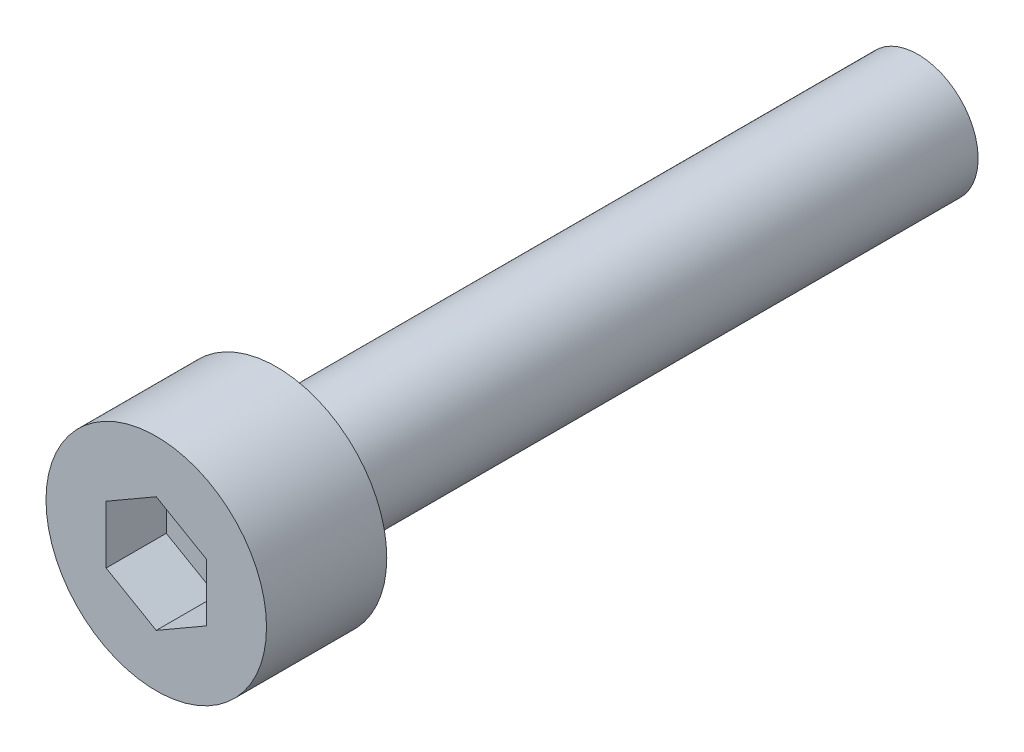
ISO-10303-21;
HEADER;
FILE_DESCRIPTION(('STEP AP214'),'2;1');
FILE_NAME('part.step','',(''),(''),'','','');
FILE_SCHEMA(('AUTOMOTIVE_DESIGN { 1 0 10303 214 1 1 1 1 }'));
ENDSEC;
DATA;
#1=APPLICATION_CONTEXT('core data for automotive mechanical design processes');
#2=APPLICATION_PROTOCOL_DEFINITION('international standard','automotive_design',2000,#1);
#3=PRODUCT_CONTEXT('',#1,'mechanical');
#4=PRODUCT('Part','Part','',(#3));
#5=PRODUCT_RELATED_PRODUCT_CATEGORY('part','',(#4));
#6=PRODUCT_DEFINITION_FORMATION('','',#4);
#7=PRODUCT_DEFINITION_CONTEXT('part definition',#1,'design');
#8=PRODUCT_DEFINITION('design','',#6,#7);
#9=PRODUCT_DEFINITION_SHAPE('','',#8);
#10=(LENGTH_UNIT() NAMED_UNIT(*) SI_UNIT(.MILLI.,.METRE.));
#11=(NAMED_UNIT(*) PLANE_ANGLE_UNIT() SI_UNIT($,.RADIAN.));
#12=(NAMED_UNIT(*) SI_UNIT($,.STERADIAN.) SOLID_ANGLE_UNIT());
#13=UNCERTAINTY_MEASURE_WITH_UNIT(LENGTH_MEASURE(1.E-05),#10,'distance_accuracy_value','');
#14=(GEOMETRIC_REPRESENTATION_CONTEXT(3) GLOBAL_UNCERTAINTY_ASSIGNED_CONTEXT((#13)) GLOBAL_UNIT_ASSIGNED_CONTEXT((#10,
#11,#12)) REPRESENTATION_CONTEXT('',''));
#15=CARTESIAN_POINT('',(0.,0.,0.));
#16=DIRECTION('',(0.,0.,1.));
#17=DIRECTION('',(1.,0.,0.));
#18=AXIS2_PLACEMENT_3D('',#15,#16,#17);
#19=CARTESIAN_POINT('',(0.,0.,3.));
#20=DIRECTION('',(0.,0.,-1.));
#21=DIRECTION('',(-1.,0.,0.));
#22=AXIS2_PLACEMENT_3D('',#19,#20,#21);
#23=CYLINDRICAL_SURFACE('',#22,2.75);
#24=CARTESIAN_POINT('',(0.,0.,3.));
#25=DIRECTION('',(0.,0.,1.));
#26=DIRECTION('',(1.,0.,0.));
#27=AXIS2_PLACEMENT_3D('',#24,#25,#26);
#28=CIRCLE('',#27,2.75);
#29=CARTESIAN_POINT('',(2.75,0.,3.));
#30=VERTEX_POINT('',#29);
#31=EDGE_CURVE('E52',#30,#30,#28,.T.);
#32=ORIENTED_EDGE('',*,*,#31,.F.);
#33=EDGE_LOOP('',(#32));
#34=FACE_BOUND('',#33,.T.);
#35=CARTESIAN_POINT('',(0.,0.,0.));
#36=DIRECTION('',(0.,0.,1.));
#37=DIRECTION('',(1.,0.,0.));
#38=AXIS2_PLACEMENT_3D('',#35,#36,#37);
#39=CIRCLE('',#38,2.75);
#40=CARTESIAN_POINT('',(2.75,0.,0.));
#41=VERTEX_POINT('',#40);
#42=EDGE_CURVE('E46',#41,#41,#39,.T.);
#43=ORIENTED_EDGE('',*,*,#42,.T.);
#44=EDGE_LOOP('',(#43));
#45=FACE_BOUND('',#44,.T.);
#46=ADVANCED_FACE('F43',(#34,#45),#23,.T.);
#47=CARTESIAN_POINT('',(0.,0.,3.));
#48=DIRECTION('',(0.,0.,1.));
#49=DIRECTION('',(1.,0.,0.));
#50=AXIS2_PLACEMENT_3D('',#47,#48,#49);
#51=PLANE('',#50);
#52=DIRECTION('',(0.866025403784439,-0.5,0.));
#53=VECTOR('',#52,1.);
#54=CARTESIAN_POINT('',(-1.25,-0.721687836487032,3.));
#55=LINE('',#54,#53);
#56=CARTESIAN_POINT('',(-1.25,-0.721687836487032,3.));
#57=VERTEX_POINT('',#56);
#58=CARTESIAN_POINT('',(0.,-1.44337567297406,3.));
#59=VERTEX_POINT('',#58);
#60=EDGE_CURVE('E60',#57,#59,#55,.T.);
#61=ORIENTED_EDGE('',*,*,#60,.F.);
#62=DIRECTION('',(0.,-1.,0.));
#63=VECTOR('',#62,1.);
#64=CARTESIAN_POINT('',(-1.25,0.721687836487032,3.));
#65=LINE('',#64,#63);
#66=CARTESIAN_POINT('',(-1.25,0.721687836487032,3.));
#67=VERTEX_POINT('',#66);
#68=EDGE_CURVE('E154',#67,#57,#65,.T.);
#69=ORIENTED_EDGE('',*,*,#68,.F.);
#70=DIRECTION('',(-0.866025403784438,-0.5,0.));
#71=VECTOR('',#70,1.);
#72=CARTESIAN_POINT('',(0.,1.44337567297407,3.));
#73=LINE('',#72,#71);
#74=CARTESIAN_POINT('',(0.,1.44337567297407,3.));
#75=VERTEX_POINT('',#74);
#76=EDGE_CURVE('E151',#75,#67,#73,.T.);
#77=ORIENTED_EDGE('',*,*,#76,.F.);
#78=DIRECTION('',(-0.866025403784439,0.5,0.));
#79=VECTOR('',#78,1.);
#80=CARTESIAN_POINT('',(1.25,0.721687836487033,3.));
#81=LINE('',#80,#79);
#82=CARTESIAN_POINT('',(1.25,0.721687836487033,3.));
#83=VERTEX_POINT('',#82);
#84=EDGE_CURVE('E108',#83,#75,#81,.T.);
#85=ORIENTED_EDGE('',*,*,#84,.F.);
#86=DIRECTION('',(0.,1.,0.));
#87=VECTOR('',#86,1.);
#88=CARTESIAN_POINT('',(1.25,-0.721687836487032,3.));
#89=LINE('',#88,#87);
#90=CARTESIAN_POINT('',(1.25,-0.721687836487032,3.));
#91=VERTEX_POINT('',#90);
#92=EDGE_CURVE('E145',#91,#83,#89,.T.);
#93=ORIENTED_EDGE('',*,*,#92,.F.);
#94=DIRECTION('',(0.866025403784439,0.5,0.));
#95=VECTOR('',#94,1.);
#96=CARTESIAN_POINT('',(0.,-1.44337567297406,3.));
#97=LINE('',#96,#95);
#98=EDGE_CURVE('E140',#59,#91,#97,.T.);
#99=ORIENTED_EDGE('',*,*,#98,.F.);
#100=EDGE_LOOP('',(#61,#69,#77,#85,#93,#99));
#101=FACE_BOUND('',#100,.T.);
#102=ORIENTED_EDGE('',*,*,#31,.T.);
#103=EDGE_LOOP('',(#102));
#104=FACE_BOUND('',#103,.T.);
#105=ADVANCED_FACE('F180',(#101,#104),#51,.T.);
#106=CARTESIAN_POINT('',(0.,0.,0.));
#107=DIRECTION('',(0.,0.,1.));
#108=DIRECTION('',(1.,0.,0.));
#109=AXIS2_PLACEMENT_3D('',#106,#107,#108);
#110=PLANE('',#109);
#111=CARTESIAN_POINT('',(0.,0.,0.));
#112=DIRECTION('',(0.,0.,-1.));
#113=DIRECTION('',(-1.,0.,0.));
#114=AXIS2_PLACEMENT_3D('',#111,#112,#113);
#115=CIRCLE('',#114,1.5);
#116=CARTESIAN_POINT('',(-1.5,0.,0.));
#117=VERTEX_POINT('',#116);
#118=EDGE_CURVE('E11',#117,#117,#115,.T.);
#119=ORIENTED_EDGE('',*,*,#118,.F.);
#120=EDGE_LOOP('',(#119));
#121=FACE_BOUND('',#120,.T.);
#122=ORIENTED_EDGE('',*,*,#42,.F.);
#123=EDGE_LOOP('',(#122));
#124=FACE_BOUND('',#123,.T.);
#125=ADVANCED_FACE('F177',(#121,#124),#110,.F.);
#126=CARTESIAN_POINT('',(-1.25,-0.721687836487032,1.5));
#127=DIRECTION('',(-0.5,-0.866025403784439,0.));
#128=DIRECTION('',(0.866025403784439,-0.5,0.));
#129=AXIS2_PLACEMENT_3D('',#126,#127,#128);
#130=PLANE('',#129);
#131=ORIENTED_EDGE('',*,*,#60,.T.);
#132=DIRECTION('',(0.,0.,1.));
#133=VECTOR('',#132,1.);
#134=CARTESIAN_POINT('',(0.,-1.44337567297406,1.5));
#135=LINE('',#134,#133);
#136=CARTESIAN_POINT('',(0.,-1.44337567297406,1.5));
#137=VERTEX_POINT('',#136);
#138=EDGE_CURVE('E90',#137,#59,#135,.T.);
#139=ORIENTED_EDGE('',*,*,#138,.F.);
#140=DIRECTION('',(0.866025403784439,-0.5,0.));
#141=VECTOR('',#140,1.);
#142=CARTESIAN_POINT('',(-1.25,-0.721687836487032,1.5));
#143=LINE('',#142,#141);
#144=CARTESIAN_POINT('',(-1.25,-0.721687836487032,1.5));
#145=VERTEX_POINT('',#144);
#146=EDGE_CURVE('E157',#145,#137,#143,.T.);
#147=ORIENTED_EDGE('',*,*,#146,.F.);
#148=DIRECTION('',(0.,0.,1.));
#149=VECTOR('',#148,1.);
#150=CARTESIAN_POINT('',(-1.25,-0.721687836487032,1.5));
#151=LINE('',#150,#149);
#152=EDGE_CURVE('E68',#145,#57,#151,.T.);
#153=ORIENTED_EDGE('',*,*,#152,.T.);
#154=EDGE_LOOP('',(#131,#139,#147,#153));
#155=FACE_BOUND('',#154,.T.);
#156=ADVANCED_FACE('F179',(#155),#130,.F.);
#157=CARTESIAN_POINT('',(-1.25,0.721687836487032,1.5));
#158=DIRECTION('',(-1.,0.,0.));
#159=DIRECTION('',(0.,0.,1.));
#160=AXIS2_PLACEMENT_3D('',#157,#158,#159);
#161=PLANE('',#160);
#162=ORIENTED_EDGE('',*,*,#68,.T.);
#163=ORIENTED_EDGE('',*,*,#152,.F.);
#164=DIRECTION('',(0.,-1.,0.));
#165=VECTOR('',#164,1.);
#166=CARTESIAN_POINT('',(-1.25,0.721687836487032,1.5));
#167=LINE('',#166,#165);
#168=CARTESIAN_POINT('',(-1.25,0.721687836487032,1.5));
#169=VERTEX_POINT('',#168);
#170=EDGE_CURVE('E122',#169,#145,#167,.T.);
#171=ORIENTED_EDGE('',*,*,#170,.F.);
#172=DIRECTION('',(0.,0.,1.));
#173=VECTOR('',#172,1.);
#174=CARTESIAN_POINT('',(-1.25,0.721687836487032,1.5));
#175=LINE('',#174,#173);
#176=EDGE_CURVE('E113',#169,#67,#175,.T.);
#177=ORIENTED_EDGE('',*,*,#176,.T.);
#178=EDGE_LOOP('',(#162,#163,#171,#177));
#179=FACE_BOUND('',#178,.T.);
#180=ADVANCED_FACE('F186',(#179),#161,.F.);
#181=CARTESIAN_POINT('',(0.,1.44337567297407,1.5));
#182=DIRECTION('',(-0.5,0.866025403784439,0.));
#183=DIRECTION('',(-0.866025403784439,-0.5,0.));
#184=AXIS2_PLACEMENT_3D('',#181,#182,#183);
#185=PLANE('',#184);
#186=ORIENTED_EDGE('',*,*,#76,.T.);
#187=ORIENTED_EDGE('',*,*,#176,.F.);
#188=DIRECTION('',(-0.866025403784438,-0.5,0.));
#189=VECTOR('',#188,1.);
#190=CARTESIAN_POINT('',(0.,1.44337567297407,1.5));
#191=LINE('',#190,#189);
#192=CARTESIAN_POINT('',(0.,1.44337567297407,1.5));
#193=VERTEX_POINT('',#192);
#194=EDGE_CURVE('E117',#193,#169,#191,.T.);
#195=ORIENTED_EDGE('',*,*,#194,.F.);
#196=DIRECTION('',(0.,0.,1.));
#197=VECTOR('',#196,1.);
#198=CARTESIAN_POINT('',(0.,1.44337567297407,1.5));
#199=LINE('',#198,#197);
#200=EDGE_CURVE('E101',#193,#75,#199,.T.);
#201=ORIENTED_EDGE('',*,*,#200,.T.);
#202=EDGE_LOOP('',(#186,#187,#195,#201));
#203=FACE_BOUND('',#202,.T.);
#204=ADVANCED_FACE('F118',(#203),#185,.F.);
#205=CARTESIAN_POINT('',(1.25,0.721687836487033,1.5));
#206=DIRECTION('',(0.5,0.866025403784439,0.));
#207=DIRECTION('',(-0.866025403784439,0.5,0.));
#208=AXIS2_PLACEMENT_3D('',#205,#206,#207);
#209=PLANE('',#208);
#210=ORIENTED_EDGE('',*,*,#84,.T.);
#211=ORIENTED_EDGE('',*,*,#200,.F.);
#212=DIRECTION('',(-0.866025403784439,0.5,0.));
#213=VECTOR('',#212,1.);
#214=CARTESIAN_POINT('',(1.25,0.721687836487033,1.5));
#215=LINE('',#214,#213);
#216=CARTESIAN_POINT('',(1.25,0.721687836487033,1.5));
#217=VERTEX_POINT('',#216);
#218=EDGE_CURVE('E105',#217,#193,#215,.T.);
#219=ORIENTED_EDGE('',*,*,#218,.F.);
#220=DIRECTION('',(0.,0.,1.));
#221=VECTOR('',#220,1.);
#222=CARTESIAN_POINT('',(1.25,0.721687836487033,1.5));
#223=LINE('',#222,#221);
#224=EDGE_CURVE('E114',#217,#83,#223,.T.);
#225=ORIENTED_EDGE('',*,*,#224,.T.);
#226=EDGE_LOOP('',(#210,#211,#219,#225));
#227=FACE_BOUND('',#226,.T.);
#228=ADVANCED_FACE('F103',(#227),#209,.F.);
#229=CARTESIAN_POINT('',(1.25,-0.721687836487032,1.5));
#230=DIRECTION('',(1.,0.,0.));
#231=DIRECTION('',(0.,1.,0.));
#232=AXIS2_PLACEMENT_3D('',#229,#230,#231);
#233=PLANE('',#232);
#234=ORIENTED_EDGE('',*,*,#92,.T.);
#235=ORIENTED_EDGE('',*,*,#224,.F.);
#236=DIRECTION('',(0.,1.,0.));
#237=VECTOR('',#236,1.);
#238=CARTESIAN_POINT('',(1.25,-0.721687836487032,1.5));
#239=LINE('',#238,#237);
#240=CARTESIAN_POINT('',(1.25,-0.721687836487032,1.5));
#241=VERTEX_POINT('',#240);
#242=EDGE_CURVE('E128',#241,#217,#239,.T.);
#243=ORIENTED_EDGE('',*,*,#242,.F.);
#244=DIRECTION('',(0.,0.,1.));
#245=VECTOR('',#244,1.);
#246=CARTESIAN_POINT('',(1.25,-0.721687836487032,1.5));
#247=LINE('',#246,#245);
#248=EDGE_CURVE('E164',#241,#91,#247,.T.);
#249=ORIENTED_EDGE('',*,*,#248,.T.);
#250=EDGE_LOOP('',(#234,#235,#243,#249));
#251=FACE_BOUND('',#250,.T.);
#252=ADVANCED_FACE('F235',(#251),#233,.F.);
#253=CARTESIAN_POINT('',(0.,-1.44337567297406,1.5));
#254=DIRECTION('',(0.5,-0.866025403784438,0.));
#255=DIRECTION('',(0.866025403784439,0.5,0.));
#256=AXIS2_PLACEMENT_3D('',#253,#254,#255);
#257=PLANE('',#256);
#258=ORIENTED_EDGE('',*,*,#98,.T.);
#259=ORIENTED_EDGE('',*,*,#248,.F.);
#260=DIRECTION('',(0.866025403784439,0.5,0.));
#261=VECTOR('',#260,1.);
#262=CARTESIAN_POINT('',(0.,-1.44337567297406,1.5));
#263=LINE('',#262,#261);
#264=EDGE_CURVE('E132',#137,#241,#263,.T.);
#265=ORIENTED_EDGE('',*,*,#264,.F.);
#266=ORIENTED_EDGE('',*,*,#138,.T.);
#267=EDGE_LOOP('',(#258,#259,#265,#266));
#268=FACE_BOUND('',#267,.T.);
#269=ADVANCED_FACE('F245',(#268),#257,.F.);
#270=CARTESIAN_POINT('',(0.,0.,1.5));
#271=DIRECTION('',(0.,0.,1.));
#272=DIRECTION('',(1.,0.,0.));
#273=AXIS2_PLACEMENT_3D('',#270,#271,#272);
#274=PLANE('',#273);
#275=ORIENTED_EDGE('',*,*,#146,.T.);
#276=ORIENTED_EDGE('',*,*,#264,.T.);
#277=ORIENTED_EDGE('',*,*,#242,.T.);
#278=ORIENTED_EDGE('',*,*,#218,.T.);
#279=ORIENTED_EDGE('',*,*,#194,.T.);
#280=ORIENTED_EDGE('',*,*,#170,.T.);
#281=EDGE_LOOP('',(#275,#276,#277,#278,#279,#280));
#282=FACE_BOUND('',#281,.T.);
#283=ADVANCED_FACE('F125',(#282),#274,.T.);
#284=CARTESIAN_POINT('',(0.,0.,-16.));
#285=DIRECTION('',(0.,0.,1.));
#286=DIRECTION('',(1.,0.,0.));
#287=AXIS2_PLACEMENT_3D('',#284,#285,#286);
#288=CYLINDRICAL_SURFACE('',#287,1.5);
#289=CARTESIAN_POINT('',(0.,0.,-16.));
#290=DIRECTION('',(0.,0.,-1.));
#291=DIRECTION('',(-1.,0.,0.));
#292=AXIS2_PLACEMENT_3D('',#289,#290,#291);
#293=CIRCLE('',#292,1.5);
#294=CARTESIAN_POINT('',(-1.5,0.,-16.));
#295=VERTEX_POINT('',#294);
#296=EDGE_CURVE('E141',#295,#295,#293,.T.);
#297=ORIENTED_EDGE('',*,*,#296,.F.);
#298=EDGE_LOOP('',(#297));
#299=FACE_BOUND('',#298,.T.);
#300=ORIENTED_EDGE('',*,*,#118,.T.);
#301=EDGE_LOOP('',(#300));
#302=FACE_BOUND('',#301,.T.);
#303=ADVANCED_FACE('F265',(#299,#302),#288,.T.);
#304=CARTESIAN_POINT('',(0.,0.,-16.));
#305=DIRECTION('',(0.,0.,-1.));
#306=DIRECTION('',(-1.,0.,0.));
#307=AXIS2_PLACEMENT_3D('',#304,#305,#306);
#308=PLANE('',#307);
#309=ORIENTED_EDGE('',*,*,#296,.T.);
#310=EDGE_LOOP('',(#309));
#311=FACE_BOUND('',#310,.T.);
#312=ADVANCED_FACE('F280',(#311),#308,.T.);
#313=CLOSED_SHELL('',(#46,#105,#125,#156,#180,#204,#228,#252,#269,#283,#303,#312));
#314=MANIFOLD_SOLID_BREP('B2',#313);
#315=ADVANCED_BREP_SHAPE_REPRESENTATION('',(#18,#314),#14);
#316=SHAPE_DEFINITION_REPRESENTATION(#9,#315);
ENDSEC;
END-ISO-10303-21;
